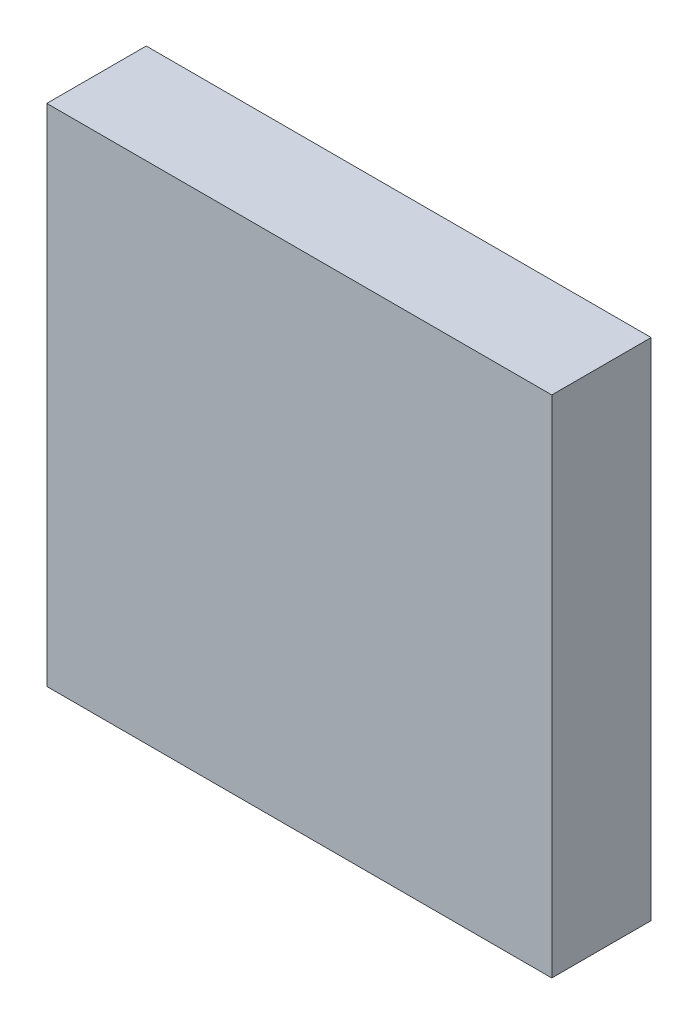
ISO-10303-21;
HEADER;
FILE_DESCRIPTION(('STEP AP214'),'2;1');
FILE_NAME('part.step','',(''),(''),'','','');
FILE_SCHEMA(('AUTOMOTIVE_DESIGN { 1 0 10303 214 1 1 1 1 }'));
ENDSEC;
DATA;
#1=APPLICATION_CONTEXT('core data for automotive mechanical design processes');
#2=APPLICATION_PROTOCOL_DEFINITION('international standard','automotive_design',2000,#1);
#3=PRODUCT_CONTEXT('',#1,'mechanical');
#4=PRODUCT('Part','Part','',(#3));
#5=PRODUCT_RELATED_PRODUCT_CATEGORY('part','',(#4));
#6=PRODUCT_DEFINITION_FORMATION('','',#4);
#7=PRODUCT_DEFINITION_CONTEXT('part definition',#1,'design');
#8=PRODUCT_DEFINITION('design','',#6,#7);
#9=PRODUCT_DEFINITION_SHAPE('','',#8);
#10=(LENGTH_UNIT() NAMED_UNIT(*) SI_UNIT(.MILLI.,.METRE.));
#11=(NAMED_UNIT(*) PLANE_ANGLE_UNIT() SI_UNIT($,.RADIAN.));
#12=(NAMED_UNIT(*) SI_UNIT($,.STERADIAN.) SOLID_ANGLE_UNIT());
#13=UNCERTAINTY_MEASURE_WITH_UNIT(LENGTH_MEASURE(1.E-05),#10,'distance_accuracy_value','');
#14=(GEOMETRIC_REPRESENTATION_CONTEXT(3) GLOBAL_UNCERTAINTY_ASSIGNED_CONTEXT((#13)) GLOBAL_UNIT_ASSIGNED_CONTEXT((#10,
#11,#12)) REPRESENTATION_CONTEXT('',''));
#15=CARTESIAN_POINT('',(0.,0.,0.));
#16=DIRECTION('',(0.,0.,1.));
#17=DIRECTION('',(1.,0.,0.));
#18=AXIS2_PLACEMENT_3D('',#15,#16,#17);
#19=CARTESIAN_POINT('',(6.34999999999987,-7.0358,-2.34192318));
#20=DIRECTION('',(0.,0.,-1.));
#21=DIRECTION('',(-1.,0.,0.));
#22=AXIS2_PLACEMENT_3D('',#19,#20,#21);
#23=PLANE('',#22);
#24=DIRECTION('',(1.,0.,0.));
#25=VECTOR('',#24,1.);
#26=CARTESIAN_POINT('',(6.34999999999987,5.6642,-2.34192318));
#27=LINE('',#26,#25);
#28=CARTESIAN_POINT('',(6.34999999999987,5.6642,-2.34192318));
#29=VERTEX_POINT('',#28);
#30=CARTESIAN_POINT('',(-6.35000000000013,5.6642,-2.34192318));
#31=VERTEX_POINT('',#30);
#32=EDGE_CURVE('E53',#29,#31,#27,.F.);
#33=ORIENTED_EDGE('',*,*,#32,.F.);
#34=DIRECTION('',(0.,1.,0.));
#35=VECTOR('',#34,1.);
#36=CARTESIAN_POINT('',(6.34999999999987,-7.0358,-2.34192318));
#37=LINE('',#36,#35);
#38=CARTESIAN_POINT('',(6.34999999999987,-7.0358,-2.34192318));
#39=VERTEX_POINT('',#38);
#40=EDGE_CURVE('E68',#39,#29,#37,.T.);
#41=ORIENTED_EDGE('',*,*,#40,.F.);
#42=DIRECTION('',(1.,0.,0.));
#43=VECTOR('',#42,1.);
#44=CARTESIAN_POINT('',(-6.35000000000013,-7.0358,-2.34192318));
#45=LINE('',#44,#43);
#46=CARTESIAN_POINT('',(-6.35000000000013,-7.0358,-2.34192318));
#47=VERTEX_POINT('',#46);
#48=EDGE_CURVE('E20',#47,#39,#45,.T.);
#49=ORIENTED_EDGE('',*,*,#48,.F.);
#50=DIRECTION('',(0.,1.,0.));
#51=VECTOR('',#50,1.);
#52=CARTESIAN_POINT('',(-6.35000000000013,5.6642,-2.34192318));
#53=LINE('',#52,#51);
#54=EDGE_CURVE('E58',#31,#47,#53,.F.);
#55=ORIENTED_EDGE('',*,*,#54,.F.);
#56=EDGE_LOOP('',(#33,#41,#49,#55));
#57=FACE_BOUND('',#56,.T.);
#58=ADVANCED_FACE('F17',(#57),#23,.T.);
#59=CARTESIAN_POINT('',(-6.35000000000013,-7.0358,0.158076860000001));
#60=DIRECTION('',(0.,-1.,0.));
#61=DIRECTION('',(0.,0.,-1.));
#62=AXIS2_PLACEMENT_3D('',#59,#60,#61);
#63=PLANE('',#62);
#64=DIRECTION('',(0.,0.,-1.));
#65=VECTOR('',#64,1.);
#66=CARTESIAN_POINT('',(6.34999999999987,-7.0358,0.158076860000001));
#67=LINE('',#66,#65);
#68=CARTESIAN_POINT('',(6.34999999999987,-7.0358,0.158076860000001));
#69=VERTEX_POINT('',#68);
#70=EDGE_CURVE('E79',#69,#39,#67,.T.);
#71=ORIENTED_EDGE('',*,*,#70,.F.);
#72=DIRECTION('',(-1.,0.,0.));
#73=VECTOR('',#72,1.);
#74=CARTESIAN_POINT('',(6.34999999999987,-7.0358,0.158076860000001));
#75=LINE('',#74,#73);
#76=CARTESIAN_POINT('',(-6.35000000000013,-7.0358,0.158076860000001));
#77=VERTEX_POINT('',#76);
#78=EDGE_CURVE('E74',#69,#77,#75,.T.);
#79=ORIENTED_EDGE('',*,*,#78,.T.);
#80=DIRECTION('',(0.,0.,1.));
#81=VECTOR('',#80,1.);
#82=CARTESIAN_POINT('',(-6.35000000000013,-7.0358,0.158076860000001));
#83=LINE('',#82,#81);
#84=EDGE_CURVE('E63',#47,#77,#83,.T.);
#85=ORIENTED_EDGE('',*,*,#84,.F.);
#86=ORIENTED_EDGE('',*,*,#48,.T.);
#87=EDGE_LOOP('',(#71,#79,#85,#86));
#88=FACE_BOUND('',#87,.T.);
#89=ADVANCED_FACE('F73',(#88),#63,.T.);
#90=CARTESIAN_POINT('',(-6.35000000000013,5.6642,0.158076860000001));
#91=DIRECTION('',(-1.,0.,0.));
#92=DIRECTION('',(0.,0.,1.));
#93=AXIS2_PLACEMENT_3D('',#90,#91,#92);
#94=PLANE('',#93);
#95=ORIENTED_EDGE('',*,*,#84,.T.);
#96=DIRECTION('',(0.,1.,0.));
#97=VECTOR('',#96,1.);
#98=CARTESIAN_POINT('',(-6.35000000000013,-7.0358,0.158076860000001));
#99=LINE('',#98,#97);
#100=CARTESIAN_POINT('',(-6.35000000000013,5.6642,0.158076860000001));
#101=VERTEX_POINT('',#100);
#102=EDGE_CURVE('E84',#77,#101,#99,.T.);
#103=ORIENTED_EDGE('',*,*,#102,.T.);
#104=DIRECTION('',(0.,0.,1.));
#105=VECTOR('',#104,1.);
#106=CARTESIAN_POINT('',(-6.35000000000013,5.6642,0.158076860000001));
#107=LINE('',#106,#105);
#108=EDGE_CURVE('E65',#31,#101,#107,.T.);
#109=ORIENTED_EDGE('',*,*,#108,.F.);
#110=ORIENTED_EDGE('',*,*,#54,.T.);
#111=EDGE_LOOP('',(#95,#103,#109,#110));
#112=FACE_BOUND('',#111,.T.);
#113=ADVANCED_FACE('F60',(#112),#94,.T.);
#114=CARTESIAN_POINT('',(6.34999999999987,5.6642,0.158076860000001));
#115=DIRECTION('',(0.,1.,0.));
#116=DIRECTION('',(0.,0.,1.));
#117=AXIS2_PLACEMENT_3D('',#114,#115,#116);
#118=PLANE('',#117);
#119=ORIENTED_EDGE('',*,*,#108,.T.);
#120=DIRECTION('',(-1.,0.,0.));
#121=VECTOR('',#120,1.);
#122=CARTESIAN_POINT('',(6.34999999999987,5.6642,0.158076860000001));
#123=LINE('',#122,#121);
#124=CARTESIAN_POINT('',(6.34999999999987,5.6642,0.158076860000001));
#125=VERTEX_POINT('',#124);
#126=EDGE_CURVE('E26',#101,#125,#123,.F.);
#127=ORIENTED_EDGE('',*,*,#126,.T.);
#128=DIRECTION('',(0.,0.,-1.));
#129=VECTOR('',#128,1.);
#130=CARTESIAN_POINT('',(6.34999999999987,5.6642,0.158076860000001));
#131=LINE('',#130,#129);
#132=EDGE_CURVE('E34',#29,#125,#131,.F.);
#133=ORIENTED_EDGE('',*,*,#132,.F.);
#134=ORIENTED_EDGE('',*,*,#32,.T.);
#135=EDGE_LOOP('',(#119,#127,#133,#134));
#136=FACE_BOUND('',#135,.T.);
#137=ADVANCED_FACE('F88',(#136),#118,.T.);
#138=CARTESIAN_POINT('',(6.34999999999987,-7.0358,0.158076860000001));
#139=DIRECTION('',(1.,0.,0.));
#140=DIRECTION('',(0.,0.,-1.));
#141=AXIS2_PLACEMENT_3D('',#138,#139,#140);
#142=PLANE('',#141);
#143=ORIENTED_EDGE('',*,*,#132,.T.);
#144=DIRECTION('',(0.,1.,0.));
#145=VECTOR('',#144,1.);
#146=CARTESIAN_POINT('',(6.34999999999987,-7.0358,0.158076860000001));
#147=LINE('',#146,#145);
#148=EDGE_CURVE('E11',#125,#69,#147,.F.);
#149=ORIENTED_EDGE('',*,*,#148,.T.);
#150=ORIENTED_EDGE('',*,*,#70,.T.);
#151=ORIENTED_EDGE('',*,*,#40,.T.);
#152=EDGE_LOOP('',(#143,#149,#150,#151));
#153=FACE_BOUND('',#152,.T.);
#154=ADVANCED_FACE('F91',(#153),#142,.T.);
#155=CARTESIAN_POINT('',(6.34999999999987,-7.0358,0.158076860000001));
#156=DIRECTION('',(0.,0.,-1.));
#157=DIRECTION('',(-1.,0.,0.));
#158=AXIS2_PLACEMENT_3D('',#155,#156,#157);
#159=PLANE('',#158);
#160=ORIENTED_EDGE('',*,*,#126,.F.);
#161=ORIENTED_EDGE('',*,*,#102,.F.);
#162=ORIENTED_EDGE('',*,*,#78,.F.);
#163=ORIENTED_EDGE('',*,*,#148,.F.);
#164=EDGE_LOOP('',(#160,#161,#162,#163));
#165=FACE_BOUND('',#164,.T.);
#166=ADVANCED_FACE('F90',(#165),#159,.F.);
#167=CLOSED_SHELL('',(#58,#89,#113,#137,#154,#166));
#168=MANIFOLD_SOLID_BREP('B1',#167);
#169=ADVANCED_BREP_SHAPE_REPRESENTATION('',(#18,#168),#14);
#170=SHAPE_DEFINITION_REPRESENTATION(#9,#169);
ENDSEC;
END-ISO-10303-21;
